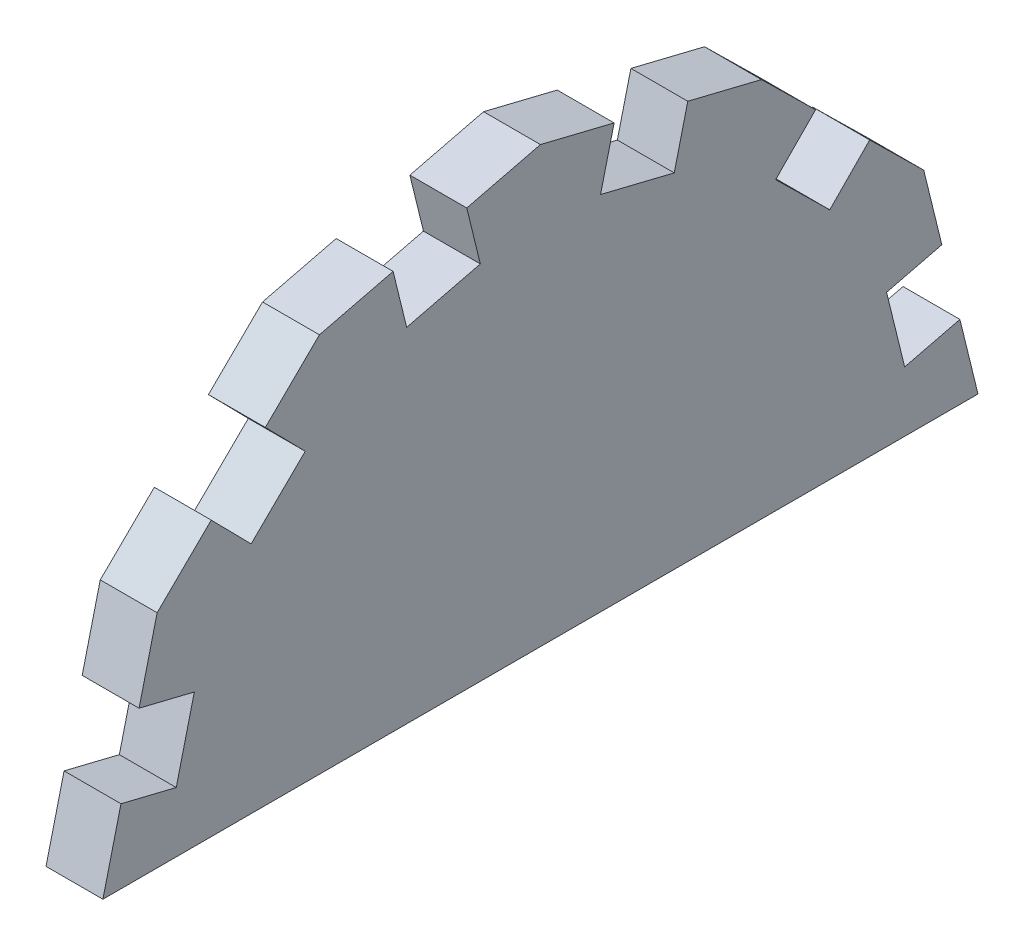
ISO-10303-21;
HEADER;
FILE_DESCRIPTION(('STEP AP214'),'2;1');
FILE_NAME('part.step','',(''),(''),'','','');
FILE_SCHEMA(('AUTOMOTIVE_DESIGN { 1 0 10303 214 1 1 1 1 }'));
ENDSEC;
DATA;
#1=APPLICATION_CONTEXT('core data for automotive mechanical design processes');
#2=APPLICATION_PROTOCOL_DEFINITION('international standard','automotive_design',2000,#1);
#3=PRODUCT_CONTEXT('',#1,'mechanical');
#4=PRODUCT('Part','Part','',(#3));
#5=PRODUCT_RELATED_PRODUCT_CATEGORY('part','',(#4));
#6=PRODUCT_DEFINITION_FORMATION('','',#4);
#7=PRODUCT_DEFINITION_CONTEXT('part definition',#1,'design');
#8=PRODUCT_DEFINITION('design','',#6,#7);
#9=PRODUCT_DEFINITION_SHAPE('','',#8);
#10=(LENGTH_UNIT() NAMED_UNIT(*) SI_UNIT(.MILLI.,.METRE.));
#11=(NAMED_UNIT(*) PLANE_ANGLE_UNIT() SI_UNIT($,.RADIAN.));
#12=(NAMED_UNIT(*) SI_UNIT($,.STERADIAN.) SOLID_ANGLE_UNIT());
#13=UNCERTAINTY_MEASURE_WITH_UNIT(LENGTH_MEASURE(1.E-05),#10,'distance_accuracy_value','');
#14=(GEOMETRIC_REPRESENTATION_CONTEXT(3) GLOBAL_UNCERTAINTY_ASSIGNED_CONTEXT((#13)) GLOBAL_UNIT_ASSIGNED_CONTEXT((#10,
#11,#12)) REPRESENTATION_CONTEXT('',''));
#15=CARTESIAN_POINT('',(0.,0.,0.));
#16=DIRECTION('',(0.,0.,1.));
#17=DIRECTION('',(1.,0.,0.));
#18=AXIS2_PLACEMENT_3D('',#15,#16,#17);
#19=CARTESIAN_POINT('',(9.525,0.,0.));
#20=DIRECTION('',(-1.,0.,0.));
#21=DIRECTION('',(0.,0.,1.));
#22=AXIS2_PLACEMENT_3D('',#19,#20,#21);
#23=PLANE('',#22);
#24=DIRECTION('',(0.,0.971169381533462,-0.238390503946596));
#25=VECTOR('',#24,1.);
#26=CARTESIAN_POINT('',(9.525,57.4897095730761,-22.3970327408586));
#27=LINE('',#26,#25);
#28=CARTESIAN_POINT('',(9.525,57.4897095730761,-22.3970327408586));
#29=VERTEX_POINT('',#28);
#30=CARTESIAN_POINT('',(9.525,66.7400979321823,-24.66770229095));
#31=VERTEX_POINT('',#30);
#32=EDGE_CURVE('E273',#29,#31,#27,.T.);
#33=ORIENTED_EDGE('',*,*,#32,.F.);
#34=DIRECTION('',(0.,0.238390503946596,0.971169381533462));
#35=VECTOR('',#34,1.);
#36=CARTESIAN_POINT('',(9.525,57.4897095730761,-22.3970327408586));
#37=LINE('',#36,#35);
#38=CARTESIAN_POINT('',(9.525,60.5172689731978,-10.0631815953837));
#39=VERTEX_POINT('',#38);
#40=EDGE_CURVE('E253',#29,#39,#37,.T.);
#41=ORIENTED_EDGE('',*,*,#40,.T.);
#42=DIRECTION('',(0.,0.971169381533462,-0.238390503946596));
#43=VECTOR('',#42,1.);
#44=CARTESIAN_POINT('',(9.525,60.5172689731978,-10.0631815953837));
#45=LINE('',#44,#43);
#46=CARTESIAN_POINT('',(9.525,69.7676573323041,-12.333851145475));
#47=VERTEX_POINT('',#46);
#48=EDGE_CURVE('E248',#39,#47,#45,.T.);
#49=ORIENTED_EDGE('',*,*,#48,.T.);
#50=DIRECTION('',(0.,0.238390503946595,0.971169381533463));
#51=VECTOR('',#50,1.);
#52=CARTESIAN_POINT('',(9.525,72.7952167324258,0.));
#53=LINE('',#52,#51);
#54=CARTESIAN_POINT('',(9.525,72.7952167324258,0.));
#55=VERTEX_POINT('',#54);
#56=EDGE_CURVE('E467',#47,#55,#53,.T.);
#57=ORIENTED_EDGE('',*,*,#56,.T.);
#58=DIRECTION('',(0.,-0.238390503946596,0.971169381533462));
#59=VECTOR('',#58,1.);
#60=CARTESIAN_POINT('',(9.525,63.7125385320605,37.0015534364249));
#61=LINE('',#60,#59);
#62=CARTESIAN_POINT('',(9.525,69.7676573323041,12.333851145475));
#63=VERTEX_POINT('',#62);
#64=EDGE_CURVE('E473',#55,#63,#61,.T.);
#65=ORIENTED_EDGE('',*,*,#64,.T.);
#66=DIRECTION('',(0.,0.971169381533462,0.238390503946596));
#67=VECTOR('',#66,1.);
#68=CARTESIAN_POINT('',(9.525,60.5172689731978,10.0631815953837));
#69=LINE('',#68,#67);
#70=CARTESIAN_POINT('',(9.525,60.5172689731978,10.0631815953837));
#71=VERTEX_POINT('',#70);
#72=EDGE_CURVE('E375',#71,#63,#69,.T.);
#73=ORIENTED_EDGE('',*,*,#72,.F.);
#74=DIRECTION('',(0.,0.238390503946596,-0.971169381533462));
#75=VECTOR('',#74,1.);
#76=CARTESIAN_POINT('',(9.525,57.4897095730761,22.3970327408586));
#77=LINE('',#76,#75);
#78=CARTESIAN_POINT('',(9.525,57.4897095730761,22.3970327408586));
#79=VERTEX_POINT('',#78);
#80=EDGE_CURVE('E359',#79,#71,#77,.T.);
#81=ORIENTED_EDGE('',*,*,#80,.F.);
#82=DIRECTION('',(0.,0.971169381533462,0.238390503946596));
#83=VECTOR('',#82,1.);
#84=CARTESIAN_POINT('',(9.525,57.4897095730761,22.3970327408586));
#85=LINE('',#84,#83);
#86=CARTESIAN_POINT('',(9.525,66.7400979321823,24.66770229095));
#87=VERTEX_POINT('',#86);
#88=EDGE_CURVE('E378',#79,#87,#85,.T.);
#89=ORIENTED_EDGE('',*,*,#88,.T.);
#90=CARTESIAN_POINT('',(9.525,63.7125385320605,37.0015534364249));
#91=VERTEX_POINT('',#90);
#92=EDGE_CURVE('E472',#87,#91,#61,.T.);
#93=ORIENTED_EDGE('',*,*,#92,.T.);
#94=DIRECTION('',(0.,-0.701075724294898,0.713086831181438));
#95=VECTOR('',#94,1.);
#96=CARTESIAN_POINT('',(9.525,37.0015534364249,64.1701617044377));
#97=LINE('',#96,#95);
#98=CARTESIAN_POINT('',(9.525,54.8088768335153,46.0577561924292));
#99=VERTEX_POINT('',#98);
#100=EDGE_CURVE('E478',#91,#99,#97,.T.);
#101=ORIENTED_EDGE('',*,*,#100,.T.);
#102=DIRECTION('',(0.,0.713086831181437,0.701075724294898));
#103=VECTOR('',#102,1.);
#104=CARTESIAN_POINT('',(9.525,48.0167247665121,39.3800099185203));
#105=LINE('',#104,#103);
#106=CARTESIAN_POINT('',(9.525,48.0167247665121,39.3800099185203));
#107=VERTEX_POINT('',#106);
#108=EDGE_CURVE('E409',#107,#99,#105,.T.);
#109=ORIENTED_EDGE('',*,*,#108,.F.);
#110=DIRECTION('',(0.,0.701075724294898,-0.713086831181438));
#111=VECTOR('',#110,1.);
#112=CARTESIAN_POINT('',(9.525,39.1130630679669,48.4362126745246));
#113=LINE('',#112,#111);
#114=CARTESIAN_POINT('',(9.525,39.1130630679669,48.4362126745246));
#115=VERTEX_POINT('',#114);
#116=EDGE_CURVE('E393',#115,#107,#113,.T.);
#117=ORIENTED_EDGE('',*,*,#116,.F.);
#118=DIRECTION('',(0.,0.713086831181437,0.701075724294898));
#119=VECTOR('',#118,1.);
#120=CARTESIAN_POINT('',(9.525,39.1130630679669,48.4362126745246));
#121=LINE('',#120,#119);
#122=CARTESIAN_POINT('',(9.525,45.9052151349701,55.1139589484335));
#123=VERTEX_POINT('',#122);
#124=EDGE_CURVE('E412',#115,#123,#121,.T.);
#125=ORIENTED_EDGE('',*,*,#124,.T.);
#126=CARTESIAN_POINT('',(9.525,37.0015534364249,64.1701617044377));
#127=VERTEX_POINT('',#126);
#128=EDGE_CURVE('E477',#123,#127,#97,.T.);
#129=ORIENTED_EDGE('',*,*,#128,.T.);
#130=DIRECTION('',(0.,-0.971169381533463,0.238390503946596));
#131=VECTOR('',#130,1.);
#132=CARTESIAN_POINT('',(9.525,0.,73.252839904803));
#133=LINE('',#132,#131);
#134=CARTESIAN_POINT('',(9.525,24.66770229095,67.1977211045595));
#135=VERTEX_POINT('',#134);
#136=EDGE_CURVE('E483',#127,#135,#133,.T.);
#137=ORIENTED_EDGE('',*,*,#136,.T.);
#138=DIRECTION('',(0.,0.238390503946596,0.971169381533463));
#139=VECTOR('',#138,1.);
#140=CARTESIAN_POINT('',(9.525,22.3970327408586,57.9473327454533));
#141=LINE('',#140,#139);
#142=CARTESIAN_POINT('',(9.525,22.3970327408586,57.9473327454533));
#143=VERTEX_POINT('',#142);
#144=EDGE_CURVE('E443',#143,#135,#141,.T.);
#145=ORIENTED_EDGE('',*,*,#144,.F.);
#146=DIRECTION('',(0.,0.971169381533463,-0.238390503946596));
#147=VECTOR('',#146,1.);
#148=CARTESIAN_POINT('',(9.525,10.0631815953837,60.974892145575));
#149=LINE('',#148,#147);
#150=CARTESIAN_POINT('',(9.525,10.0631815953837,60.974892145575));
#151=VERTEX_POINT('',#150);
#152=EDGE_CURVE('E427',#151,#143,#149,.T.);
#153=ORIENTED_EDGE('',*,*,#152,.F.);
#154=DIRECTION('',(0.,0.238390503946596,0.971169381533463));
#155=VECTOR('',#154,1.);
#156=CARTESIAN_POINT('',(9.525,10.0631815953837,60.974892145575));
#157=LINE('',#156,#155);
#158=CARTESIAN_POINT('',(9.525,12.333851145475,70.2252805046813));
#159=VERTEX_POINT('',#158);
#160=EDGE_CURVE('E446',#151,#159,#157,.T.);
#161=ORIENTED_EDGE('',*,*,#160,.T.);
#162=CARTESIAN_POINT('',(9.525,0.,73.252839904803));
#163=VERTEX_POINT('',#162);
#164=EDGE_CURVE('E482',#159,#163,#133,.T.);
#165=ORIENTED_EDGE('',*,*,#164,.T.);
#166=DIRECTION('',(0.,0.,-1.));
#167=VECTOR('',#166,1.);
#168=CARTESIAN_POINT('',(9.525,0.,-73.252839904803));
#169=LINE('',#168,#167);
#170=CARTESIAN_POINT('',(9.525,0.,-73.252839904803));
#171=VERTEX_POINT('',#170);
#172=EDGE_CURVE('E452',#163,#171,#169,.T.);
#173=ORIENTED_EDGE('',*,*,#172,.T.);
#174=DIRECTION('',(0.,0.971169381533463,0.238390503946596));
#175=VECTOR('',#174,1.);
#176=CARTESIAN_POINT('',(9.525,37.0015534364249,-64.1701617044377));
#177=LINE('',#176,#175);
#178=CARTESIAN_POINT('',(9.525,12.333851145475,-70.2252805046813));
#179=VERTEX_POINT('',#178);
#180=EDGE_CURVE('E458',#171,#179,#177,.T.);
#181=ORIENTED_EDGE('',*,*,#180,.T.);
#182=DIRECTION('',(0.,0.238390503946596,-0.971169381533463));
#183=VECTOR('',#182,1.);
#184=CARTESIAN_POINT('',(9.525,10.0631815953837,-60.974892145575));
#185=LINE('',#184,#183);
#186=CARTESIAN_POINT('',(9.525,10.0631815953837,-60.974892145575));
#187=VERTEX_POINT('',#186);
#188=EDGE_CURVE('E341',#187,#179,#185,.T.);
#189=ORIENTED_EDGE('',*,*,#188,.F.);
#190=DIRECTION('',(0.,0.971169381533463,0.238390503946596));
#191=VECTOR('',#190,1.);
#192=CARTESIAN_POINT('',(9.525,10.0631815953837,-60.974892145575));
#193=LINE('',#192,#191);
#194=CARTESIAN_POINT('',(9.525,22.3970327408586,-57.9473327454533));
#195=VERTEX_POINT('',#194);
#196=EDGE_CURVE('E322',#187,#195,#193,.T.);
#197=ORIENTED_EDGE('',*,*,#196,.T.);
#198=DIRECTION('',(0.,0.238390503946596,-0.971169381533463));
#199=VECTOR('',#198,1.);
#200=CARTESIAN_POINT('',(9.525,22.3970327408586,-57.9473327454533));
#201=LINE('',#200,#199);
#202=CARTESIAN_POINT('',(9.525,24.66770229095,-67.1977211045595));
#203=VERTEX_POINT('',#202);
#204=EDGE_CURVE('E344',#195,#203,#201,.T.);
#205=ORIENTED_EDGE('',*,*,#204,.T.);
#206=CARTESIAN_POINT('',(9.525,37.0015534364249,-64.1701617044377));
#207=VERTEX_POINT('',#206);
#208=EDGE_CURVE('E456',#203,#207,#177,.T.);
#209=ORIENTED_EDGE('',*,*,#208,.T.);
#210=DIRECTION('',(0.,0.701075724294898,0.713086831181437));
#211=VECTOR('',#210,1.);
#212=CARTESIAN_POINT('',(9.525,63.7125385320605,-37.0015534364249));
#213=LINE('',#212,#211);
#214=CARTESIAN_POINT('',(9.525,45.9052151349701,-55.1139589484335));
#215=VERTEX_POINT('',#214);
#216=EDGE_CURVE('E463',#207,#215,#213,.T.);
#217=ORIENTED_EDGE('',*,*,#216,.T.);
#218=DIRECTION('',(0.,0.713086831181437,-0.701075724294898));
#219=VECTOR('',#218,1.);
#220=CARTESIAN_POINT('',(9.525,39.1130630679669,-48.4362126745246));
#221=LINE('',#220,#219);
#222=CARTESIAN_POINT('',(9.525,39.1130630679669,-48.4362126745246));
#223=VERTEX_POINT('',#222);
#224=EDGE_CURVE('E305',#223,#215,#221,.T.);
#225=ORIENTED_EDGE('',*,*,#224,.F.);
#226=DIRECTION('',(0.,0.701075724294898,0.713086831181438));
#227=VECTOR('',#226,1.);
#228=CARTESIAN_POINT('',(9.525,39.1130630679669,-48.4362126745246));
#229=LINE('',#228,#227);
#230=CARTESIAN_POINT('',(9.525,48.0167247665121,-39.3800099185203));
#231=VERTEX_POINT('',#230);
#232=EDGE_CURVE('E286',#223,#231,#229,.T.);
#233=ORIENTED_EDGE('',*,*,#232,.T.);
#234=DIRECTION('',(0.,0.713086831181437,-0.701075724294898));
#235=VECTOR('',#234,1.);
#236=CARTESIAN_POINT('',(9.525,48.0167247665121,-39.3800099185203));
#237=LINE('',#236,#235);
#238=CARTESIAN_POINT('',(9.525,54.8088768335153,-46.0577561924292));
#239=VERTEX_POINT('',#238);
#240=EDGE_CURVE('E308',#231,#239,#237,.T.);
#241=ORIENTED_EDGE('',*,*,#240,.T.);
#242=CARTESIAN_POINT('',(9.525,63.7125385320605,-37.0015534364249));
#243=VERTEX_POINT('',#242);
#244=EDGE_CURVE('E462',#239,#243,#213,.T.);
#245=ORIENTED_EDGE('',*,*,#244,.T.);
#246=EDGE_CURVE('E468',#243,#31,#53,.T.);
#247=ORIENTED_EDGE('',*,*,#246,.T.);
#248=EDGE_LOOP('',(#33,#41,#49,#57,#65,#73,#81,#89,#93,#101,#109,#117,#125,#129,#137,#145,#153,
#161,#165,#173,#181,#189,#197,#205,#209,#217,#225,#233,#241,#245,#247));
#249=FACE_BOUND('',#248,.T.);
#250=ADVANCED_FACE('F42',(#249),#23,.F.);
#251=CARTESIAN_POINT('',(0.,0.,0.));
#252=DIRECTION('',(-1.,0.,0.));
#253=DIRECTION('',(0.,0.,1.));
#254=AXIS2_PLACEMENT_3D('',#251,#252,#253);
#255=PLANE('',#254);
#256=DIRECTION('',(0.,-0.238390503946596,-0.971169381533462));
#257=VECTOR('',#256,1.);
#258=CARTESIAN_POINT('',(0.,57.4897095730761,-22.3970327408586));
#259=LINE('',#258,#257);
#260=CARTESIAN_POINT('',(0.,60.5172689731978,-10.0631815953837));
#261=VERTEX_POINT('',#260);
#262=CARTESIAN_POINT('',(0.,57.4897095730761,-22.3970327408586));
#263=VERTEX_POINT('',#262);
#264=EDGE_CURVE('E254',#261,#263,#259,.T.);
#265=ORIENTED_EDGE('',*,*,#264,.T.);
#266=DIRECTION('',(0.,0.971169381533462,-0.238390503946596));
#267=VECTOR('',#266,1.);
#268=CARTESIAN_POINT('',(0.,57.4897095730761,-22.3970327408586));
#269=LINE('',#268,#267);
#270=CARTESIAN_POINT('',(0.,66.7400979321823,-24.66770229095));
#271=VERTEX_POINT('',#270);
#272=EDGE_CURVE('E296',#263,#271,#269,.T.);
#273=ORIENTED_EDGE('',*,*,#272,.T.);
#274=DIRECTION('',(0.,0.238390503946595,0.971169381533463));
#275=VECTOR('',#274,1.);
#276=CARTESIAN_POINT('',(0.,72.7952167324258,0.));
#277=LINE('',#276,#275);
#278=CARTESIAN_POINT('',(0.,63.7125385320605,-37.0015534364249));
#279=VERTEX_POINT('',#278);
#280=EDGE_CURVE('E501',#279,#271,#277,.T.);
#281=ORIENTED_EDGE('',*,*,#280,.F.);
#282=DIRECTION('',(0.,0.701075724294898,0.713086831181437));
#283=VECTOR('',#282,1.);
#284=CARTESIAN_POINT('',(0.,63.7125385320605,-37.0015534364249));
#285=LINE('',#284,#283);
#286=CARTESIAN_POINT('',(0.,54.8088768335153,-46.0577561924292));
#287=VERTEX_POINT('',#286);
#288=EDGE_CURVE('E496',#287,#279,#285,.T.);
#289=ORIENTED_EDGE('',*,*,#288,.F.);
#290=DIRECTION('',(0.,0.713086831181437,-0.701075724294898));
#291=VECTOR('',#290,1.);
#292=CARTESIAN_POINT('',(0.,48.0167247665121,-39.3800099185203));
#293=LINE('',#292,#291);
#294=CARTESIAN_POINT('',(0.,48.0167247665121,-39.3800099185203));
#295=VERTEX_POINT('',#294);
#296=EDGE_CURVE('E66',#295,#287,#293,.T.);
#297=ORIENTED_EDGE('',*,*,#296,.F.);
#298=DIRECTION('',(0.,-0.701075724294898,-0.713086831181438));
#299=VECTOR('',#298,1.);
#300=CARTESIAN_POINT('',(0.,39.1130630679669,-48.4362126745246));
#301=LINE('',#300,#299);
#302=CARTESIAN_POINT('',(0.,39.1130630679669,-48.4362126745246));
#303=VERTEX_POINT('',#302);
#304=EDGE_CURVE('E278',#295,#303,#301,.T.);
#305=ORIENTED_EDGE('',*,*,#304,.T.);
#306=DIRECTION('',(0.,0.713086831181437,-0.701075724294898));
#307=VECTOR('',#306,1.);
#308=CARTESIAN_POINT('',(0.,39.1130630679669,-48.4362126745246));
#309=LINE('',#308,#307);
#310=CARTESIAN_POINT('',(0.,45.9052151349701,-55.1139589484335));
#311=VERTEX_POINT('',#310);
#312=EDGE_CURVE('E300',#303,#311,#309,.T.);
#313=ORIENTED_EDGE('',*,*,#312,.T.);
#314=CARTESIAN_POINT('',(0.,37.0015534364249,-64.1701617044377));
#315=VERTEX_POINT('',#314);
#316=EDGE_CURVE('E497',#315,#311,#285,.T.);
#317=ORIENTED_EDGE('',*,*,#316,.F.);
#318=DIRECTION('',(0.,0.971169381533463,0.238390503946596));
#319=VECTOR('',#318,1.);
#320=CARTESIAN_POINT('',(0.,37.0015534364249,-64.1701617044377));
#321=LINE('',#320,#319);
#322=CARTESIAN_POINT('',(0.,24.66770229095,-67.1977211045595));
#323=VERTEX_POINT('',#322);
#324=EDGE_CURVE('E491',#323,#315,#321,.T.);
#325=ORIENTED_EDGE('',*,*,#324,.F.);
#326=DIRECTION('',(0.,0.238390503946596,-0.971169381533463));
#327=VECTOR('',#326,1.);
#328=CARTESIAN_POINT('',(0.,22.3970327408586,-57.9473327454533));
#329=LINE('',#328,#327);
#330=CARTESIAN_POINT('',(0.,22.3970327408586,-57.9473327454533));
#331=VERTEX_POINT('',#330);
#332=EDGE_CURVE('E329',#331,#323,#329,.T.);
#333=ORIENTED_EDGE('',*,*,#332,.F.);
#334=DIRECTION('',(0.,-0.971169381533463,-0.238390503946596));
#335=VECTOR('',#334,1.);
#336=CARTESIAN_POINT('',(0.,10.0631815953837,-60.974892145575));
#337=LINE('',#336,#335);
#338=CARTESIAN_POINT('',(0.,10.0631815953837,-60.974892145575));
#339=VERTEX_POINT('',#338);
#340=EDGE_CURVE('E314',#331,#339,#337,.T.);
#341=ORIENTED_EDGE('',*,*,#340,.T.);
#342=DIRECTION('',(0.,0.238390503946596,-0.971169381533463));
#343=VECTOR('',#342,1.);
#344=CARTESIAN_POINT('',(0.,10.0631815953837,-60.974892145575));
#345=LINE('',#344,#343);
#346=CARTESIAN_POINT('',(0.,12.333851145475,-70.2252805046813));
#347=VERTEX_POINT('',#346);
#348=EDGE_CURVE('E336',#339,#347,#345,.T.);
#349=ORIENTED_EDGE('',*,*,#348,.T.);
#350=CARTESIAN_POINT('',(0.,0.,-73.252839904803));
#351=VERTEX_POINT('',#350);
#352=EDGE_CURVE('E492',#351,#347,#321,.T.);
#353=ORIENTED_EDGE('',*,*,#352,.F.);
#354=DIRECTION('',(0.,0.,-1.));
#355=VECTOR('',#354,1.);
#356=CARTESIAN_POINT('',(0.,0.,-73.252839904803));
#357=LINE('',#356,#355);
#358=CARTESIAN_POINT('',(0.,0.,73.252839904803));
#359=VERTEX_POINT('',#358);
#360=EDGE_CURVE('E442',#359,#351,#357,.T.);
#361=ORIENTED_EDGE('',*,*,#360,.F.);
#362=DIRECTION('',(0.,-0.971169381533463,0.238390503946596));
#363=VECTOR('',#362,1.);
#364=CARTESIAN_POINT('',(0.,0.,73.252839904803));
#365=LINE('',#364,#363);
#366=CARTESIAN_POINT('',(0.,12.333851145475,70.2252805046813));
#367=VERTEX_POINT('',#366);
#368=EDGE_CURVE('E515',#367,#359,#365,.T.);
#369=ORIENTED_EDGE('',*,*,#368,.F.);
#370=DIRECTION('',(0.,0.238390503946596,0.971169381533463));
#371=VECTOR('',#370,1.);
#372=CARTESIAN_POINT('',(0.,10.0631815953837,60.974892145575));
#373=LINE('',#372,#371);
#374=CARTESIAN_POINT('',(0.,10.0631815953837,60.974892145575));
#375=VERTEX_POINT('',#374);
#376=EDGE_CURVE('E433',#375,#367,#373,.T.);
#377=ORIENTED_EDGE('',*,*,#376,.F.);
#378=DIRECTION('',(0.,-0.971169381533463,0.238390503946596));
#379=VECTOR('',#378,1.);
#380=CARTESIAN_POINT('',(0.,10.0631815953837,60.974892145575));
#381=LINE('',#380,#379);
#382=CARTESIAN_POINT('',(0.,22.3970327408586,57.9473327454533));
#383=VERTEX_POINT('',#382);
#384=EDGE_CURVE('E418',#383,#375,#381,.T.);
#385=ORIENTED_EDGE('',*,*,#384,.F.);
#386=DIRECTION('',(0.,0.238390503946596,0.971169381533463));
#387=VECTOR('',#386,1.);
#388=CARTESIAN_POINT('',(0.,22.3970327408586,57.9473327454533));
#389=LINE('',#388,#387);
#390=CARTESIAN_POINT('',(0.,24.66770229095,67.1977211045595));
#391=VERTEX_POINT('',#390);
#392=EDGE_CURVE('E438',#383,#391,#389,.T.);
#393=ORIENTED_EDGE('',*,*,#392,.T.);
#394=CARTESIAN_POINT('',(0.,37.0015534364249,64.1701617044377));
#395=VERTEX_POINT('',#394);
#396=EDGE_CURVE('E457',#395,#391,#365,.T.);
#397=ORIENTED_EDGE('',*,*,#396,.F.);
#398=DIRECTION('',(0.,-0.701075724294898,0.713086831181438));
#399=VECTOR('',#398,1.);
#400=CARTESIAN_POINT('',(0.,37.0015534364249,64.1701617044377));
#401=LINE('',#400,#399);
#402=CARTESIAN_POINT('',(0.,45.9052151349701,55.1139589484335));
#403=VERTEX_POINT('',#402);
#404=EDGE_CURVE('E510',#403,#395,#401,.T.);
#405=ORIENTED_EDGE('',*,*,#404,.F.);
#406=DIRECTION('',(0.,0.713086831181437,0.701075724294898));
#407=VECTOR('',#406,1.);
#408=CARTESIAN_POINT('',(0.,39.1130630679669,48.4362126745246));
#409=LINE('',#408,#407);
#410=CARTESIAN_POINT('',(0.,39.1130630679669,48.4362126745246));
#411=VERTEX_POINT('',#410);
#412=EDGE_CURVE('E399',#411,#403,#409,.T.);
#413=ORIENTED_EDGE('',*,*,#412,.F.);
#414=DIRECTION('',(0.,-0.701075724294898,0.713086831181438));
#415=VECTOR('',#414,1.);
#416=CARTESIAN_POINT('',(0.,39.1130630679669,48.4362126745246));
#417=LINE('',#416,#415);
#418=CARTESIAN_POINT('',(0.,48.0167247665121,39.3800099185203));
#419=VERTEX_POINT('',#418);
#420=EDGE_CURVE('E384',#419,#411,#417,.T.);
#421=ORIENTED_EDGE('',*,*,#420,.F.);
#422=DIRECTION('',(0.,0.713086831181437,0.701075724294898));
#423=VECTOR('',#422,1.);
#424=CARTESIAN_POINT('',(0.,48.0167247665121,39.3800099185203));
#425=LINE('',#424,#423);
#426=CARTESIAN_POINT('',(0.,54.8088768335153,46.0577561924292));
#427=VERTEX_POINT('',#426);
#428=EDGE_CURVE('E404',#419,#427,#425,.T.);
#429=ORIENTED_EDGE('',*,*,#428,.T.);
#430=CARTESIAN_POINT('',(0.,63.7125385320605,37.0015534364249));
#431=VERTEX_POINT('',#430);
#432=EDGE_CURVE('E511',#431,#427,#401,.T.);
#433=ORIENTED_EDGE('',*,*,#432,.F.);
#434=DIRECTION('',(0.,-0.238390503946596,0.971169381533462));
#435=VECTOR('',#434,1.);
#436=CARTESIAN_POINT('',(0.,63.7125385320605,37.0015534364249));
#437=LINE('',#436,#435);
#438=CARTESIAN_POINT('',(0.,66.7400979321823,24.66770229095));
#439=VERTEX_POINT('',#438);
#440=EDGE_CURVE('E505',#439,#431,#437,.T.);
#441=ORIENTED_EDGE('',*,*,#440,.F.);
#442=DIRECTION('',(0.,0.971169381533462,0.238390503946596));
#443=VECTOR('',#442,1.);
#444=CARTESIAN_POINT('',(0.,57.4897095730761,22.3970327408586));
#445=LINE('',#444,#443);
#446=CARTESIAN_POINT('',(0.,57.4897095730761,22.3970327408586));
#447=VERTEX_POINT('',#446);
#448=EDGE_CURVE('E365',#447,#439,#445,.T.);
#449=ORIENTED_EDGE('',*,*,#448,.F.);
#450=DIRECTION('',(0.,-0.238390503946596,0.971169381533462));
#451=VECTOR('',#450,1.);
#452=CARTESIAN_POINT('',(0.,57.4897095730761,22.3970327408586));
#453=LINE('',#452,#451);
#454=CARTESIAN_POINT('',(0.,60.5172689731979,10.0631815953837));
#455=VERTEX_POINT('',#454);
#456=EDGE_CURVE('E350',#455,#447,#453,.T.);
#457=ORIENTED_EDGE('',*,*,#456,.F.);
#458=DIRECTION('',(0.,0.971169381533462,0.238390503946596));
#459=VECTOR('',#458,1.);
#460=CARTESIAN_POINT('',(0.,60.5172689731978,10.0631815953837));
#461=LINE('',#460,#459);
#462=CARTESIAN_POINT('',(0.,69.7676573323041,12.333851145475));
#463=VERTEX_POINT('',#462);
#464=EDGE_CURVE('E370',#455,#463,#461,.T.);
#465=ORIENTED_EDGE('',*,*,#464,.T.);
#466=CARTESIAN_POINT('',(0.,72.7952167324258,0.));
#467=VERTEX_POINT('',#466);
#468=EDGE_CURVE('E506',#467,#463,#437,.T.);
#469=ORIENTED_EDGE('',*,*,#468,.F.);
#470=CARTESIAN_POINT('',(0.,69.7676573323041,-12.333851145475));
#471=VERTEX_POINT('',#470);
#472=EDGE_CURVE('E268',#471,#467,#277,.T.);
#473=ORIENTED_EDGE('',*,*,#472,.F.);
#474=DIRECTION('',(0.,0.971169381533462,-0.238390503946596));
#475=VECTOR('',#474,1.);
#476=CARTESIAN_POINT('',(0.,60.5172689731978,-10.0631815953837));
#477=LINE('',#476,#475);
#478=EDGE_CURVE('E58',#261,#471,#477,.T.);
#479=ORIENTED_EDGE('',*,*,#478,.F.);
#480=EDGE_LOOP('',(#265,#273,#281,#289,#297,#305,#313,#317,#325,#333,#341,#349,#353,#361,#369,
#377,#385,#393,#397,#405,#413,#421,#429,#433,#441,#449,#457,#465,#469,#473,#479));
#481=FACE_BOUND('',#480,.T.);
#482=ADVANCED_FACE('F266',(#481),#255,.T.);
#483=CARTESIAN_POINT('',(9.525,72.7952167324258,0.));
#484=DIRECTION('',(0.,-0.971169381533463,0.238390503946595));
#485=DIRECTION('',(0.,-0.238390503946595,-0.971169381533463));
#486=AXIS2_PLACEMENT_3D('',#483,#484,#485);
#487=PLANE('',#486);
#488=DIRECTION('',(1.,0.,0.));
#489=VECTOR('',#488,1.);
#490=CARTESIAN_POINT('',(0.,66.7400979321823,-24.66770229095));
#491=LINE('',#490,#489);
#492=EDGE_CURVE('E263',#271,#31,#491,.T.);
#493=ORIENTED_EDGE('',*,*,#492,.T.);
#494=ORIENTED_EDGE('',*,*,#246,.F.);
#495=DIRECTION('',(-1.,0.,0.));
#496=VECTOR('',#495,1.);
#497=CARTESIAN_POINT('',(9.525,63.7125385320605,-37.0015534364249));
#498=LINE('',#497,#496);
#499=EDGE_CURVE('E534',#243,#279,#498,.T.);
#500=ORIENTED_EDGE('',*,*,#499,.T.);
#501=ORIENTED_EDGE('',*,*,#280,.T.);
#502=EDGE_LOOP('',(#493,#494,#500,#501));
#503=FACE_BOUND('',#502,.T.);
#504=ADVANCED_FACE('F581',(#503),#487,.F.);
#505=DIRECTION('',(-1.,0.,0.));
#506=VECTOR('',#505,1.);
#507=CARTESIAN_POINT('',(0.,69.7676573323041,-12.333851145475));
#508=LINE('',#507,#506);
#509=EDGE_CURVE('E572',#47,#471,#508,.T.);
#510=ORIENTED_EDGE('',*,*,#509,.T.);
#511=ORIENTED_EDGE('',*,*,#472,.T.);
#512=DIRECTION('',(-1.,0.,0.));
#513=VECTOR('',#512,1.);
#514=CARTESIAN_POINT('',(9.525,72.7952167324258,0.));
#515=LINE('',#514,#513);
#516=EDGE_CURVE('E530',#55,#467,#515,.T.);
#517=ORIENTED_EDGE('',*,*,#516,.F.);
#518=ORIENTED_EDGE('',*,*,#56,.F.);
#519=EDGE_LOOP('',(#510,#511,#517,#518));
#520=FACE_BOUND('',#519,.T.);
#521=ADVANCED_FACE('F630',(#520),#487,.F.);
#522=CARTESIAN_POINT('',(9.525,63.7125385320605,-37.0015534364249));
#523=DIRECTION('',(0.,-0.713086831181437,0.701075724294898));
#524=DIRECTION('',(0.,-0.701075724294898,-0.713086831181438));
#525=AXIS2_PLACEMENT_3D('',#522,#523,#524);
#526=PLANE('',#525);
#527=DIRECTION('',(1.,0.,0.));
#528=VECTOR('',#527,1.);
#529=CARTESIAN_POINT('',(0.,45.9052151349701,-55.1139589484335));
#530=LINE('',#529,#528);
#531=EDGE_CURVE('E283',#311,#215,#530,.T.);
#532=ORIENTED_EDGE('',*,*,#531,.T.);
#533=ORIENTED_EDGE('',*,*,#216,.F.);
#534=DIRECTION('',(-1.,0.,0.));
#535=VECTOR('',#534,1.);
#536=CARTESIAN_POINT('',(9.525,37.0015534364249,-64.1701617044377));
#537=LINE('',#536,#535);
#538=EDGE_CURVE('E51',#207,#315,#537,.T.);
#539=ORIENTED_EDGE('',*,*,#538,.T.);
#540=ORIENTED_EDGE('',*,*,#316,.T.);
#541=EDGE_LOOP('',(#532,#533,#539,#540));
#542=FACE_BOUND('',#541,.T.);
#543=ADVANCED_FACE('F543',(#542),#526,.F.);
#544=DIRECTION('',(-1.,0.,0.));
#545=VECTOR('',#544,1.);
#546=CARTESIAN_POINT('',(0.,54.8088768335153,-46.0577561924292));
#547=LINE('',#546,#545);
#548=EDGE_CURVE('E293',#239,#287,#547,.T.);
#549=ORIENTED_EDGE('',*,*,#548,.T.);
#550=ORIENTED_EDGE('',*,*,#288,.T.);
#551=ORIENTED_EDGE('',*,*,#499,.F.);
#552=ORIENTED_EDGE('',*,*,#244,.F.);
#553=EDGE_LOOP('',(#549,#550,#551,#552));
#554=FACE_BOUND('',#553,.T.);
#555=ADVANCED_FACE('F586',(#554),#526,.F.);
#556=CARTESIAN_POINT('',(9.525,37.0015534364249,-64.1701617044377));
#557=DIRECTION('',(0.,-0.238390503946596,0.971169381533463));
#558=DIRECTION('',(0.,-0.971169381533463,-0.238390503946596));
#559=AXIS2_PLACEMENT_3D('',#556,#557,#558);
#560=PLANE('',#559);
#561=DIRECTION('',(1.,0.,0.));
#562=VECTOR('',#561,1.);
#563=CARTESIAN_POINT('',(0.,12.333851145475,-70.2252805046813));
#564=LINE('',#563,#562);
#565=EDGE_CURVE('E319',#347,#179,#564,.T.);
#566=ORIENTED_EDGE('',*,*,#565,.T.);
#567=ORIENTED_EDGE('',*,*,#180,.F.);
#568=DIRECTION('',(-1.,0.,0.));
#569=VECTOR('',#568,1.);
#570=CARTESIAN_POINT('',(9.525,0.,-73.252839904803));
#571=LINE('',#570,#569);
#572=EDGE_CURVE('E11',#171,#351,#571,.T.);
#573=ORIENTED_EDGE('',*,*,#572,.T.);
#574=ORIENTED_EDGE('',*,*,#352,.T.);
#575=EDGE_LOOP('',(#566,#567,#573,#574));
#576=FACE_BOUND('',#575,.T.);
#577=ADVANCED_FACE('F632',(#576),#560,.F.);
#578=DIRECTION('',(-1.,0.,0.));
#579=VECTOR('',#578,1.);
#580=CARTESIAN_POINT('',(0.,24.66770229095,-67.1977211045595));
#581=LINE('',#580,#579);
#582=EDGE_CURVE('E304',#203,#323,#581,.T.);
#583=ORIENTED_EDGE('',*,*,#582,.T.);
#584=ORIENTED_EDGE('',*,*,#324,.T.);
#585=ORIENTED_EDGE('',*,*,#538,.F.);
#586=ORIENTED_EDGE('',*,*,#208,.F.);
#587=EDGE_LOOP('',(#583,#584,#585,#586));
#588=FACE_BOUND('',#587,.T.);
#589=ADVANCED_FACE('F634',(#588),#560,.F.);
#590=CARTESIAN_POINT('',(9.525,63.7125385320605,37.0015534364249));
#591=DIRECTION('',(0.,-0.971169381533463,-0.238390503946596));
#592=DIRECTION('',(0.,0.238390503946596,-0.971169381533463));
#593=AXIS2_PLACEMENT_3D('',#590,#591,#592);
#594=PLANE('',#593);
#595=ORIENTED_EDGE('',*,*,#468,.T.);
#596=DIRECTION('',(-1.,0.,0.));
#597=VECTOR('',#596,1.);
#598=CARTESIAN_POINT('',(0.,69.7676573323041,12.333851145475));
#599=LINE('',#598,#597);
#600=EDGE_CURVE('E355',#63,#463,#599,.T.);
#601=ORIENTED_EDGE('',*,*,#600,.F.);
#602=ORIENTED_EDGE('',*,*,#64,.F.);
#603=ORIENTED_EDGE('',*,*,#516,.T.);
#604=EDGE_LOOP('',(#595,#601,#602,#603));
#605=FACE_BOUND('',#604,.T.);
#606=ADVANCED_FACE('F627',(#605),#594,.F.);
#607=CARTESIAN_POINT('',(9.525,37.0015534364249,64.1701617044377));
#608=DIRECTION('',(0.,-0.713086831181438,-0.701075724294898));
#609=DIRECTION('',(0.,0.701075724294898,-0.713086831181438));
#610=AXIS2_PLACEMENT_3D('',#607,#608,#609);
#611=PLANE('',#610);
#612=ORIENTED_EDGE('',*,*,#432,.T.);
#613=DIRECTION('',(-1.,0.,0.));
#614=VECTOR('',#613,1.);
#615=CARTESIAN_POINT('',(0.,54.8088768335153,46.0577561924292));
#616=LINE('',#615,#614);
#617=EDGE_CURVE('E389',#99,#427,#616,.T.);
#618=ORIENTED_EDGE('',*,*,#617,.F.);
#619=ORIENTED_EDGE('',*,*,#100,.F.);
#620=DIRECTION('',(-1.,0.,0.));
#621=VECTOR('',#620,1.);
#622=CARTESIAN_POINT('',(9.525,63.7125385320605,37.0015534364249));
#623=LINE('',#622,#621);
#624=EDGE_CURVE('E526',#91,#431,#623,.T.);
#625=ORIENTED_EDGE('',*,*,#624,.T.);
#626=EDGE_LOOP('',(#612,#618,#619,#625));
#627=FACE_BOUND('',#626,.T.);
#628=ADVANCED_FACE('F623',(#627),#611,.F.);
#629=CARTESIAN_POINT('',(9.525,0.,73.252839904803));
#630=DIRECTION('',(0.,-0.238390503946596,-0.971169381533463));
#631=DIRECTION('',(0.,0.971169381533463,-0.238390503946596));
#632=AXIS2_PLACEMENT_3D('',#629,#630,#631);
#633=PLANE('',#632);
#634=ORIENTED_EDGE('',*,*,#396,.T.);
#635=DIRECTION('',(-1.,0.,0.));
#636=VECTOR('',#635,1.);
#637=CARTESIAN_POINT('',(0.,24.66770229095,67.1977211045595));
#638=LINE('',#637,#636);
#639=EDGE_CURVE('E423',#135,#391,#638,.T.);
#640=ORIENTED_EDGE('',*,*,#639,.F.);
#641=ORIENTED_EDGE('',*,*,#136,.F.);
#642=DIRECTION('',(-1.,0.,0.));
#643=VECTOR('',#642,1.);
#644=CARTESIAN_POINT('',(9.525,37.0015534364249,64.1701617044377));
#645=LINE('',#644,#643);
#646=EDGE_CURVE('E522',#127,#395,#645,.T.);
#647=ORIENTED_EDGE('',*,*,#646,.T.);
#648=EDGE_LOOP('',(#634,#640,#641,#647));
#649=FACE_BOUND('',#648,.T.);
#650=ADVANCED_FACE('F618',(#649),#633,.F.);
#651=CARTESIAN_POINT('',(9.525,0.,-73.252839904803));
#652=DIRECTION('',(0.,1.,0.));
#653=DIRECTION('',(0.,0.,1.));
#654=AXIS2_PLACEMENT_3D('',#651,#652,#653);
#655=PLANE('',#654);
#656=ORIENTED_EDGE('',*,*,#360,.T.);
#657=ORIENTED_EDGE('',*,*,#572,.F.);
#658=ORIENTED_EDGE('',*,*,#172,.F.);
#659=DIRECTION('',(-1.,0.,0.));
#660=VECTOR('',#659,1.);
#661=CARTESIAN_POINT('',(9.525,0.,73.252839904803));
#662=LINE('',#661,#660);
#663=EDGE_CURVE('E487',#163,#359,#662,.T.);
#664=ORIENTED_EDGE('',*,*,#663,.T.);
#665=EDGE_LOOP('',(#656,#657,#658,#664));
#666=FACE_BOUND('',#665,.T.);
#667=ADVANCED_FACE('F44',(#666),#655,.F.);
#668=ORIENTED_EDGE('',*,*,#92,.F.);
#669=DIRECTION('',(1.,0.,0.));
#670=VECTOR('',#669,1.);
#671=CARTESIAN_POINT('',(0.,66.7400979321823,24.66770229095));
#672=LINE('',#671,#670);
#673=EDGE_CURVE('E340',#439,#87,#672,.T.);
#674=ORIENTED_EDGE('',*,*,#673,.F.);
#675=ORIENTED_EDGE('',*,*,#440,.T.);
#676=ORIENTED_EDGE('',*,*,#624,.F.);
#677=EDGE_LOOP('',(#668,#674,#675,#676));
#678=FACE_BOUND('',#677,.T.);
#679=ADVANCED_FACE('F621',(#678),#594,.F.);
#680=ORIENTED_EDGE('',*,*,#128,.F.);
#681=DIRECTION('',(1.,0.,0.));
#682=VECTOR('',#681,1.);
#683=CARTESIAN_POINT('',(0.,45.9052151349701,55.1139589484335));
#684=LINE('',#683,#682);
#685=EDGE_CURVE('E374',#403,#123,#684,.T.);
#686=ORIENTED_EDGE('',*,*,#685,.F.);
#687=ORIENTED_EDGE('',*,*,#404,.T.);
#688=ORIENTED_EDGE('',*,*,#646,.F.);
#689=EDGE_LOOP('',(#680,#686,#687,#688));
#690=FACE_BOUND('',#689,.T.);
#691=ADVANCED_FACE('F616',(#690),#611,.F.);
#692=ORIENTED_EDGE('',*,*,#164,.F.);
#693=DIRECTION('',(1.,0.,0.));
#694=VECTOR('',#693,1.);
#695=CARTESIAN_POINT('',(0.,12.333851145475,70.2252805046813));
#696=LINE('',#695,#694);
#697=EDGE_CURVE('E408',#367,#159,#696,.T.);
#698=ORIENTED_EDGE('',*,*,#697,.F.);
#699=ORIENTED_EDGE('',*,*,#368,.T.);
#700=ORIENTED_EDGE('',*,*,#663,.F.);
#701=EDGE_LOOP('',(#692,#698,#699,#700));
#702=FACE_BOUND('',#701,.T.);
#703=ADVANCED_FACE('F612',(#702),#633,.F.);
#704=CARTESIAN_POINT('',(0.,22.3970327408586,57.9473327454533));
#705=DIRECTION('',(0.,0.971169381533462,-0.238390503946596));
#706=DIRECTION('',(0.,0.238390503946596,0.971169381533463));
#707=AXIS2_PLACEMENT_3D('',#704,#705,#706);
#708=PLANE('',#707);
#709=ORIENTED_EDGE('',*,*,#639,.T.);
#710=ORIENTED_EDGE('',*,*,#392,.F.);
#711=DIRECTION('',(-1.,0.,0.));
#712=VECTOR('',#711,1.);
#713=CARTESIAN_POINT('',(0.,22.3970327408586,57.9473327454533));
#714=LINE('',#713,#712);
#715=EDGE_CURVE('E430',#143,#383,#714,.T.);
#716=ORIENTED_EDGE('',*,*,#715,.F.);
#717=ORIENTED_EDGE('',*,*,#144,.T.);
#718=EDGE_LOOP('',(#709,#710,#716,#717));
#719=FACE_BOUND('',#718,.T.);
#720=ADVANCED_FACE('F615',(#719),#708,.F.);
#721=CARTESIAN_POINT('',(0.,10.0631815953837,60.974892145575));
#722=DIRECTION('',(0.,-0.971169381533462,0.238390503946596));
#723=DIRECTION('',(0.,-0.238390503946596,-0.971169381533463));
#724=AXIS2_PLACEMENT_3D('',#721,#722,#723);
#725=PLANE('',#724);
#726=ORIENTED_EDGE('',*,*,#697,.T.);
#727=ORIENTED_EDGE('',*,*,#160,.F.);
#728=DIRECTION('',(1.,0.,0.));
#729=VECTOR('',#728,1.);
#730=CARTESIAN_POINT('',(0.,10.0631815953837,60.974892145575));
#731=LINE('',#730,#729);
#732=EDGE_CURVE('E422',#375,#151,#731,.T.);
#733=ORIENTED_EDGE('',*,*,#732,.F.);
#734=ORIENTED_EDGE('',*,*,#376,.T.);
#735=EDGE_LOOP('',(#726,#727,#733,#734));
#736=FACE_BOUND('',#735,.T.);
#737=ADVANCED_FACE('F609',(#736),#725,.F.);
#738=CARTESIAN_POINT('',(0.,14.6886490818372,59.8394902825724));
#739=DIRECTION('',(0.,-0.238390503946596,-0.971169381533463));
#740=DIRECTION('',(0.,0.971169381533462,-0.238390503946596));
#741=AXIS2_PLACEMENT_3D('',#738,#739,#740);
#742=PLANE('',#741);
#743=ORIENTED_EDGE('',*,*,#384,.T.);
#744=ORIENTED_EDGE('',*,*,#732,.T.);
#745=ORIENTED_EDGE('',*,*,#152,.T.);
#746=ORIENTED_EDGE('',*,*,#715,.T.);
#747=EDGE_LOOP('',(#743,#744,#745,#746));
#748=FACE_BOUND('',#747,.T.);
#749=ADVANCED_FACE('F688',(#748),#742,.F.);
#750=CARTESIAN_POINT('',(0.,48.0167247665121,39.3800099185203));
#751=DIRECTION('',(0.,0.701075724294898,-0.713086831181437));
#752=DIRECTION('',(0.,0.713086831181437,0.701075724294898));
#753=AXIS2_PLACEMENT_3D('',#750,#751,#752);
#754=PLANE('',#753);
#755=ORIENTED_EDGE('',*,*,#617,.T.);
#756=ORIENTED_EDGE('',*,*,#428,.F.);
#757=DIRECTION('',(-1.,0.,0.));
#758=VECTOR('',#757,1.);
#759=CARTESIAN_POINT('',(0.,48.0167247665121,39.3800099185203));
#760=LINE('',#759,#758);
#761=EDGE_CURVE('E396',#107,#419,#760,.T.);
#762=ORIENTED_EDGE('',*,*,#761,.F.);
#763=ORIENTED_EDGE('',*,*,#108,.T.);
#764=EDGE_LOOP('',(#755,#756,#762,#763));
#765=FACE_BOUND('',#764,.T.);
#766=ADVANCED_FACE('F685',(#765),#754,.F.);
#767=CARTESIAN_POINT('',(0.,39.1130630679669,48.4362126745246));
#768=DIRECTION('',(0.,-0.701075724294898,0.713086831181437));
#769=DIRECTION('',(0.,-0.713086831181437,-0.701075724294898));
#770=AXIS2_PLACEMENT_3D('',#767,#768,#769);
#771=PLANE('',#770);
#772=ORIENTED_EDGE('',*,*,#685,.T.);
#773=ORIENTED_EDGE('',*,*,#124,.F.);
#774=DIRECTION('',(1.,0.,0.));
#775=VECTOR('',#774,1.);
#776=CARTESIAN_POINT('',(0.,39.1130630679669,48.4362126745246));
#777=LINE('',#776,#775);
#778=EDGE_CURVE('E388',#411,#115,#777,.T.);
#779=ORIENTED_EDGE('',*,*,#778,.F.);
#780=ORIENTED_EDGE('',*,*,#412,.T.);
#781=EDGE_LOOP('',(#772,#773,#779,#780));
#782=FACE_BOUND('',#781,.T.);
#783=ADVANCED_FACE('F683',(#782),#771,.F.);
#784=CARTESIAN_POINT('',(0.,44.1033245538907,43.3604560530226));
#785=DIRECTION('',(0.,-0.713086831181438,-0.701075724294898));
#786=DIRECTION('',(0.,0.701075724294898,-0.713086831181438));
#787=AXIS2_PLACEMENT_3D('',#784,#785,#786);
#788=PLANE('',#787);
#789=ORIENTED_EDGE('',*,*,#420,.T.);
#790=ORIENTED_EDGE('',*,*,#778,.T.);
#791=ORIENTED_EDGE('',*,*,#116,.T.);
#792=ORIENTED_EDGE('',*,*,#761,.T.);
#793=EDGE_LOOP('',(#789,#790,#791,#792));
#794=FACE_BOUND('',#793,.T.);
#795=ADVANCED_FACE('F676',(#794),#788,.F.);
#796=CARTESIAN_POINT('',(0.,60.5172689731978,10.0631815953837));
#797=DIRECTION('',(0.,0.238390503946596,-0.971169381533462));
#798=DIRECTION('',(0.,0.971169381533463,0.238390503946596));
#799=AXIS2_PLACEMENT_3D('',#796,#797,#798);
#800=PLANE('',#799);
#801=ORIENTED_EDGE('',*,*,#600,.T.);
#802=ORIENTED_EDGE('',*,*,#464,.F.);
#803=DIRECTION('',(-1.,0.,0.));
#804=VECTOR('',#803,1.);
#805=CARTESIAN_POINT('',(0.,60.5172689731978,10.0631815953837));
#806=LINE('',#805,#804);
#807=EDGE_CURVE('E362',#71,#455,#806,.T.);
#808=ORIENTED_EDGE('',*,*,#807,.F.);
#809=ORIENTED_EDGE('',*,*,#72,.T.);
#810=EDGE_LOOP('',(#801,#802,#808,#809));
#811=FACE_BOUND('',#810,.T.);
#812=ADVANCED_FACE('F673',(#811),#800,.F.);
#813=CARTESIAN_POINT('',(0.,57.4897095730761,22.3970327408586));
#814=DIRECTION('',(0.,-0.238390503946596,0.971169381533462));
#815=DIRECTION('',(0.,-0.971169381533463,-0.238390503946596));
#816=AXIS2_PLACEMENT_3D('',#813,#814,#815);
#817=PLANE('',#816);
#818=ORIENTED_EDGE('',*,*,#673,.T.);
#819=ORIENTED_EDGE('',*,*,#88,.F.);
#820=DIRECTION('',(1.,0.,0.));
#821=VECTOR('',#820,1.);
#822=CARTESIAN_POINT('',(0.,57.4897095730761,22.3970327408586));
#823=LINE('',#822,#821);
#824=EDGE_CURVE('E354',#447,#79,#823,.T.);
#825=ORIENTED_EDGE('',*,*,#824,.F.);
#826=ORIENTED_EDGE('',*,*,#448,.T.);
#827=EDGE_LOOP('',(#818,#819,#825,#826));
#828=FACE_BOUND('',#827,.T.);
#829=ADVANCED_FACE('F671',(#828),#817,.F.);
#830=CARTESIAN_POINT('',(0.,59.4078738498955,14.5827012823555));
#831=DIRECTION('',(0.,-0.971169381533463,-0.238390503946596));
#832=DIRECTION('',(0.,0.238390503946596,-0.971169381533463));
#833=AXIS2_PLACEMENT_3D('',#830,#831,#832);
#834=PLANE('',#833);
#835=ORIENTED_EDGE('',*,*,#456,.T.);
#836=ORIENTED_EDGE('',*,*,#824,.T.);
#837=ORIENTED_EDGE('',*,*,#80,.T.);
#838=ORIENTED_EDGE('',*,*,#807,.T.);
#839=EDGE_LOOP('',(#835,#836,#837,#838));
#840=FACE_BOUND('',#839,.T.);
#841=ADVANCED_FACE('F666',(#840),#834,.F.);
#842=CARTESIAN_POINT('',(0.,10.0631815953837,-60.974892145575));
#843=DIRECTION('',(0.,0.971169381533462,0.238390503946596));
#844=DIRECTION('',(0.,-0.238390503946596,0.971169381533463));
#845=AXIS2_PLACEMENT_3D('',#842,#843,#844);
#846=PLANE('',#845);
#847=ORIENTED_EDGE('',*,*,#565,.F.);
#848=ORIENTED_EDGE('',*,*,#348,.F.);
#849=DIRECTION('',(1.,0.,0.));
#850=VECTOR('',#849,1.);
#851=CARTESIAN_POINT('',(0.,10.0631815953837,-60.974892145575));
#852=LINE('',#851,#850);
#853=EDGE_CURVE('E326',#339,#187,#852,.T.);
#854=ORIENTED_EDGE('',*,*,#853,.T.);
#855=ORIENTED_EDGE('',*,*,#188,.T.);
#856=EDGE_LOOP('',(#847,#848,#854,#855));
#857=FACE_BOUND('',#856,.T.);
#858=ADVANCED_FACE('F652',(#857),#846,.T.);
#859=CARTESIAN_POINT('',(0.,22.3970327408586,-57.9473327454533));
#860=DIRECTION('',(0.,-0.971169381533462,-0.238390503946596));
#861=DIRECTION('',(0.,0.238390503946596,-0.971169381533463));
#862=AXIS2_PLACEMENT_3D('',#859,#860,#861);
#863=PLANE('',#862);
#864=ORIENTED_EDGE('',*,*,#582,.F.);
#865=ORIENTED_EDGE('',*,*,#204,.F.);
#866=DIRECTION('',(-1.,0.,0.));
#867=VECTOR('',#866,1.);
#868=CARTESIAN_POINT('',(0.,22.3970327408586,-57.9473327454533));
#869=LINE('',#868,#867);
#870=EDGE_CURVE('E318',#195,#331,#869,.T.);
#871=ORIENTED_EDGE('',*,*,#870,.T.);
#872=ORIENTED_EDGE('',*,*,#332,.T.);
#873=EDGE_LOOP('',(#864,#865,#871,#872));
#874=FACE_BOUND('',#873,.T.);
#875=ADVANCED_FACE('F658',(#874),#863,.T.);
#876=CARTESIAN_POINT('',(0.,14.6886490818372,-59.8394902825724));
#877=DIRECTION('',(0.,-0.238390503946596,0.971169381533463));
#878=DIRECTION('',(0.,0.971169381533462,0.238390503946596));
#879=AXIS2_PLACEMENT_3D('',#876,#877,#878);
#880=PLANE('',#879);
#881=ORIENTED_EDGE('',*,*,#340,.F.);
#882=ORIENTED_EDGE('',*,*,#870,.F.);
#883=ORIENTED_EDGE('',*,*,#196,.F.);
#884=ORIENTED_EDGE('',*,*,#853,.F.);
#885=EDGE_LOOP('',(#881,#882,#883,#884));
#886=FACE_BOUND('',#885,.T.);
#887=ADVANCED_FACE('F655',(#886),#880,.F.);
#888=CARTESIAN_POINT('',(0.,39.1130630679669,-48.4362126745246));
#889=DIRECTION('',(0.,0.701075724294898,0.713086831181437));
#890=DIRECTION('',(0.,-0.713086831181437,0.701075724294898));
#891=AXIS2_PLACEMENT_3D('',#888,#889,#890);
#892=PLANE('',#891);
#893=ORIENTED_EDGE('',*,*,#531,.F.);
#894=ORIENTED_EDGE('',*,*,#312,.F.);
#895=DIRECTION('',(1.,0.,0.));
#896=VECTOR('',#895,1.);
#897=CARTESIAN_POINT('',(0.,39.1130630679669,-48.4362126745246));
#898=LINE('',#897,#896);
#899=EDGE_CURVE('E290',#303,#223,#898,.T.);
#900=ORIENTED_EDGE('',*,*,#899,.T.);
#901=ORIENTED_EDGE('',*,*,#224,.T.);
#902=EDGE_LOOP('',(#893,#894,#900,#901));
#903=FACE_BOUND('',#902,.T.);
#904=ADVANCED_FACE('F551',(#903),#892,.T.);
#905=CARTESIAN_POINT('',(0.,48.0167247665121,-39.3800099185203));
#906=DIRECTION('',(0.,-0.701075724294898,-0.713086831181437));
#907=DIRECTION('',(0.,0.713086831181437,-0.701075724294898));
#908=AXIS2_PLACEMENT_3D('',#905,#906,#907);
#909=PLANE('',#908);
#910=ORIENTED_EDGE('',*,*,#548,.F.);
#911=ORIENTED_EDGE('',*,*,#240,.F.);
#912=DIRECTION('',(-1.,0.,0.));
#913=VECTOR('',#912,1.);
#914=CARTESIAN_POINT('',(0.,48.0167247665121,-39.3800099185203));
#915=LINE('',#914,#913);
#916=EDGE_CURVE('E282',#231,#295,#915,.T.);
#917=ORIENTED_EDGE('',*,*,#916,.T.);
#918=ORIENTED_EDGE('',*,*,#296,.T.);
#919=EDGE_LOOP('',(#910,#911,#917,#918));
#920=FACE_BOUND('',#919,.T.);
#921=ADVANCED_FACE('F587',(#920),#909,.T.);
#922=CARTESIAN_POINT('',(0.,44.1033245538907,-43.3604560530226));
#923=DIRECTION('',(0.,-0.713086831181438,0.701075724294898));
#924=DIRECTION('',(0.,0.701075724294898,0.713086831181438));
#925=AXIS2_PLACEMENT_3D('',#922,#923,#924);
#926=PLANE('',#925);
#927=ORIENTED_EDGE('',*,*,#304,.F.);
#928=ORIENTED_EDGE('',*,*,#916,.F.);
#929=ORIENTED_EDGE('',*,*,#232,.F.);
#930=ORIENTED_EDGE('',*,*,#899,.F.);
#931=EDGE_LOOP('',(#927,#928,#929,#930));
#932=FACE_BOUND('',#931,.T.);
#933=ADVANCED_FACE('F590',(#932),#926,.F.);
#934=CARTESIAN_POINT('',(0.,57.4897095730761,-22.3970327408586));
#935=DIRECTION('',(0.,0.238390503946596,0.971169381533462));
#936=DIRECTION('',(0.,-0.971169381533463,0.238390503946596));
#937=AXIS2_PLACEMENT_3D('',#934,#935,#936);
#938=PLANE('',#937);
#939=ORIENTED_EDGE('',*,*,#492,.F.);
#940=ORIENTED_EDGE('',*,*,#272,.F.);
#941=DIRECTION('',(1.,0.,0.));
#942=VECTOR('',#941,1.);
#943=CARTESIAN_POINT('',(0.,57.4897095730761,-22.3970327408586));
#944=LINE('',#943,#942);
#945=EDGE_CURVE('E258',#263,#29,#944,.T.);
#946=ORIENTED_EDGE('',*,*,#945,.T.);
#947=ORIENTED_EDGE('',*,*,#32,.T.);
#948=EDGE_LOOP('',(#939,#940,#946,#947));
#949=FACE_BOUND('',#948,.T.);
#950=ADVANCED_FACE('F583',(#949),#938,.T.);
#951=CARTESIAN_POINT('',(0.,60.5172689731978,-10.0631815953837));
#952=DIRECTION('',(0.,-0.238390503946596,-0.971169381533462));
#953=DIRECTION('',(0.,0.971169381533463,-0.238390503946596));
#954=AXIS2_PLACEMENT_3D('',#951,#952,#953);
#955=PLANE('',#954);
#956=ORIENTED_EDGE('',*,*,#509,.F.);
#957=ORIENTED_EDGE('',*,*,#48,.F.);
#958=DIRECTION('',(-1.,0.,0.));
#959=VECTOR('',#958,1.);
#960=CARTESIAN_POINT('',(0.,60.5172689731978,-10.0631815953837));
#961=LINE('',#960,#959);
#962=EDGE_CURVE('E244',#39,#261,#961,.T.);
#963=ORIENTED_EDGE('',*,*,#962,.T.);
#964=ORIENTED_EDGE('',*,*,#478,.T.);
#965=EDGE_LOOP('',(#956,#957,#963,#964));
#966=FACE_BOUND('',#965,.T.);
#967=ADVANCED_FACE('F246',(#966),#955,.T.);
#968=CARTESIAN_POINT('',(0.,59.4078738498955,-14.5827012823555));
#969=DIRECTION('',(0.,-0.971169381533463,0.238390503946596));
#970=DIRECTION('',(0.,0.238390503946596,0.971169381533463));
#971=AXIS2_PLACEMENT_3D('',#968,#969,#970);
#972=PLANE('',#971);
#973=ORIENTED_EDGE('',*,*,#264,.F.);
#974=ORIENTED_EDGE('',*,*,#962,.F.);
#975=ORIENTED_EDGE('',*,*,#40,.F.);
#976=ORIENTED_EDGE('',*,*,#945,.F.);
#977=EDGE_LOOP('',(#973,#974,#975,#976));
#978=FACE_BOUND('',#977,.T.);
#979=ADVANCED_FACE('F257',(#978),#972,.F.);
#980=CLOSED_SHELL('',(#250,#482,#504,#521,#543,#555,#577,#589,#606,#628,#650,#667,#679,#691,
#703,#720,#737,#749,#766,#783,#795,#812,#829,#841,#858,#875,#887,#904,#921,#933,#950,#967,#979));
#981=MANIFOLD_SOLID_BREP('B2',#980);
#982=ADVANCED_BREP_SHAPE_REPRESENTATION('',(#18,#981),#14);
#983=SHAPE_DEFINITION_REPRESENTATION(#9,#982);
ENDSEC;
END-ISO-10303-21;
